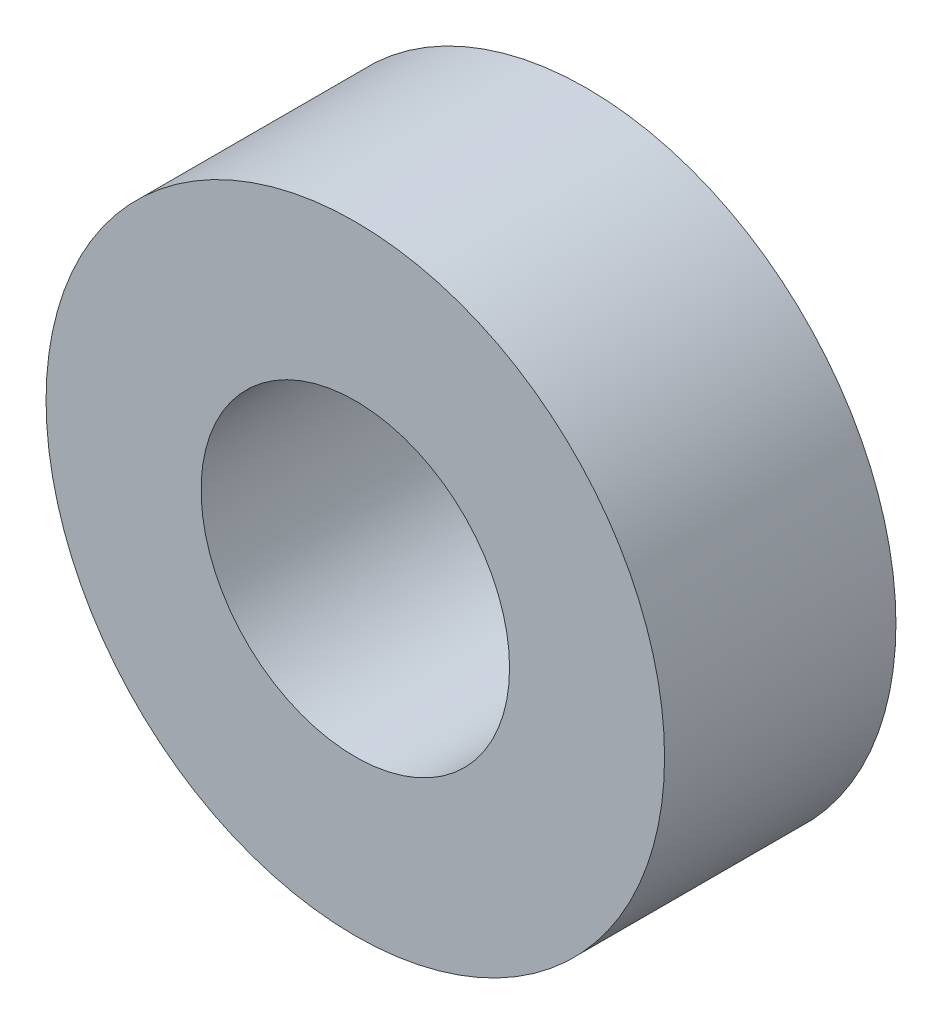
ISO-10303-21;
HEADER;
FILE_DESCRIPTION(('STEP AP214'),'2;1');
FILE_NAME('part.step','',(''),(''),'','','');
FILE_SCHEMA(('AUTOMOTIVE_DESIGN { 1 0 10303 214 1 1 1 1 }'));
ENDSEC;
DATA;
#1=APPLICATION_CONTEXT('core data for automotive mechanical design processes');
#2=APPLICATION_PROTOCOL_DEFINITION('international standard','automotive_design',2000,#1);
#3=PRODUCT_CONTEXT('',#1,'mechanical');
#4=PRODUCT('Part','Part','',(#3));
#5=PRODUCT_RELATED_PRODUCT_CATEGORY('part','',(#4));
#6=PRODUCT_DEFINITION_FORMATION('','',#4);
#7=PRODUCT_DEFINITION_CONTEXT('part definition',#1,'design');
#8=PRODUCT_DEFINITION('design','',#6,#7);
#9=PRODUCT_DEFINITION_SHAPE('','',#8);
#10=(LENGTH_UNIT() NAMED_UNIT(*) SI_UNIT(.MILLI.,.METRE.));
#11=(NAMED_UNIT(*) PLANE_ANGLE_UNIT() SI_UNIT($,.RADIAN.));
#12=(NAMED_UNIT(*) SI_UNIT($,.STERADIAN.) SOLID_ANGLE_UNIT());
#13=UNCERTAINTY_MEASURE_WITH_UNIT(LENGTH_MEASURE(1.E-05),#10,'distance_accuracy_value','');
#14=(GEOMETRIC_REPRESENTATION_CONTEXT(3) GLOBAL_UNCERTAINTY_ASSIGNED_CONTEXT((#13)) GLOBAL_UNIT_ASSIGNED_CONTEXT((#10,
#11,#12)) REPRESENTATION_CONTEXT('',''));
#15=CARTESIAN_POINT('',(0.,0.,0.));
#16=DIRECTION('',(0.,0.,1.));
#17=DIRECTION('',(1.,0.,0.));
#18=AXIS2_PLACEMENT_3D('',#15,#16,#17);
#19=CARTESIAN_POINT('',(0.,0.,1.5));
#20=DIRECTION('',(0.,0.,1.));
#21=DIRECTION('',(1.,0.,0.));
#22=AXIS2_PLACEMENT_3D('',#19,#20,#21);
#23=PLANE('',#22);
#24=CARTESIAN_POINT('',(0.,0.,1.5));
#25=DIRECTION('',(0.,0.,1.));
#26=DIRECTION('',(1.,0.,0.));
#27=AXIS2_PLACEMENT_3D('',#24,#25,#26);
#28=CIRCLE('',#27,4.01);
#29=CARTESIAN_POINT('',(4.01,0.,1.5));
#30=VERTEX_POINT('',#29);
#31=EDGE_CURVE('E10',#30,#30,#28,.T.);
#32=ORIENTED_EDGE('',*,*,#31,.T.);
#33=EDGE_LOOP('',(#32));
#34=FACE_BOUND('',#33,.T.);
#35=CARTESIAN_POINT('',(0.,0.,1.5));
#36=DIRECTION('',(0.,0.,1.));
#37=DIRECTION('',(1.,0.,0.));
#38=AXIS2_PLACEMENT_3D('',#35,#36,#37);
#39=CIRCLE('',#38,2.);
#40=CARTESIAN_POINT('',(2.,0.,1.5));
#41=VERTEX_POINT('',#40);
#42=EDGE_CURVE('E42',#41,#41,#39,.T.);
#43=ORIENTED_EDGE('',*,*,#42,.F.);
#44=EDGE_LOOP('',(#43));
#45=FACE_BOUND('',#44,.T.);
#46=ADVANCED_FACE('F31',(#34,#45),#23,.T.);
#47=CARTESIAN_POINT('',(0.,0.,-1.5));
#48=DIRECTION('',(0.,0.,1.));
#49=DIRECTION('',(1.,0.,0.));
#50=AXIS2_PLACEMENT_3D('',#47,#48,#49);
#51=PLANE('',#50);
#52=CARTESIAN_POINT('',(0.,0.,-1.5));
#53=DIRECTION('',(0.,0.,1.));
#54=DIRECTION('',(1.,0.,0.));
#55=AXIS2_PLACEMENT_3D('',#52,#53,#54);
#56=CIRCLE('',#55,4.01);
#57=CARTESIAN_POINT('',(4.01,0.,-1.5));
#58=VERTEX_POINT('',#57);
#59=EDGE_CURVE('E35',#58,#58,#56,.T.);
#60=ORIENTED_EDGE('',*,*,#59,.F.);
#61=EDGE_LOOP('',(#60));
#62=FACE_BOUND('',#61,.T.);
#63=CARTESIAN_POINT('',(0.,0.,-1.5));
#64=DIRECTION('',(0.,0.,1.));
#65=DIRECTION('',(1.,0.,0.));
#66=AXIS2_PLACEMENT_3D('',#63,#64,#65);
#67=CIRCLE('',#66,2.);
#68=CARTESIAN_POINT('',(2.,0.,-1.5));
#69=VERTEX_POINT('',#68);
#70=EDGE_CURVE('E44',#69,#69,#67,.T.);
#71=ORIENTED_EDGE('',*,*,#70,.T.);
#72=EDGE_LOOP('',(#71));
#73=FACE_BOUND('',#72,.T.);
#74=ADVANCED_FACE('F54',(#62,#73),#51,.F.);
#75=CARTESIAN_POINT('',(0.,0.,1.5));
#76=DIRECTION('',(0.,0.,-1.));
#77=DIRECTION('',(-1.,0.,0.));
#78=AXIS2_PLACEMENT_3D('',#75,#76,#77);
#79=CYLINDRICAL_SURFACE('',#78,4.01);
#80=ORIENTED_EDGE('',*,*,#31,.F.);
#81=EDGE_LOOP('',(#80));
#82=FACE_BOUND('',#81,.T.);
#83=ORIENTED_EDGE('',*,*,#59,.T.);
#84=EDGE_LOOP('',(#83));
#85=FACE_BOUND('',#84,.T.);
#86=ADVANCED_FACE('F33',(#82,#85),#79,.T.);
#87=CARTESIAN_POINT('',(0.,0.,1.5));
#88=DIRECTION('',(0.,0.,-1.));
#89=DIRECTION('',(-1.,0.,0.));
#90=AXIS2_PLACEMENT_3D('',#87,#88,#89);
#91=CYLINDRICAL_SURFACE('',#90,2.);
#92=ORIENTED_EDGE('',*,*,#42,.T.);
#93=EDGE_LOOP('',(#92));
#94=FACE_BOUND('',#93,.T.);
#95=ORIENTED_EDGE('',*,*,#70,.F.);
#96=EDGE_LOOP('',(#95));
#97=FACE_BOUND('',#96,.T.);
#98=ADVANCED_FACE('F50',(#94,#97),#91,.F.);
#99=CLOSED_SHELL('',(#46,#74,#86,#98));
#100=MANIFOLD_SOLID_BREP('B2',#99);
#101=ADVANCED_BREP_SHAPE_REPRESENTATION('',(#18,#100),#14);
#102=SHAPE_DEFINITION_REPRESENTATION(#9,#101);
ENDSEC;
END-ISO-10303-21;
